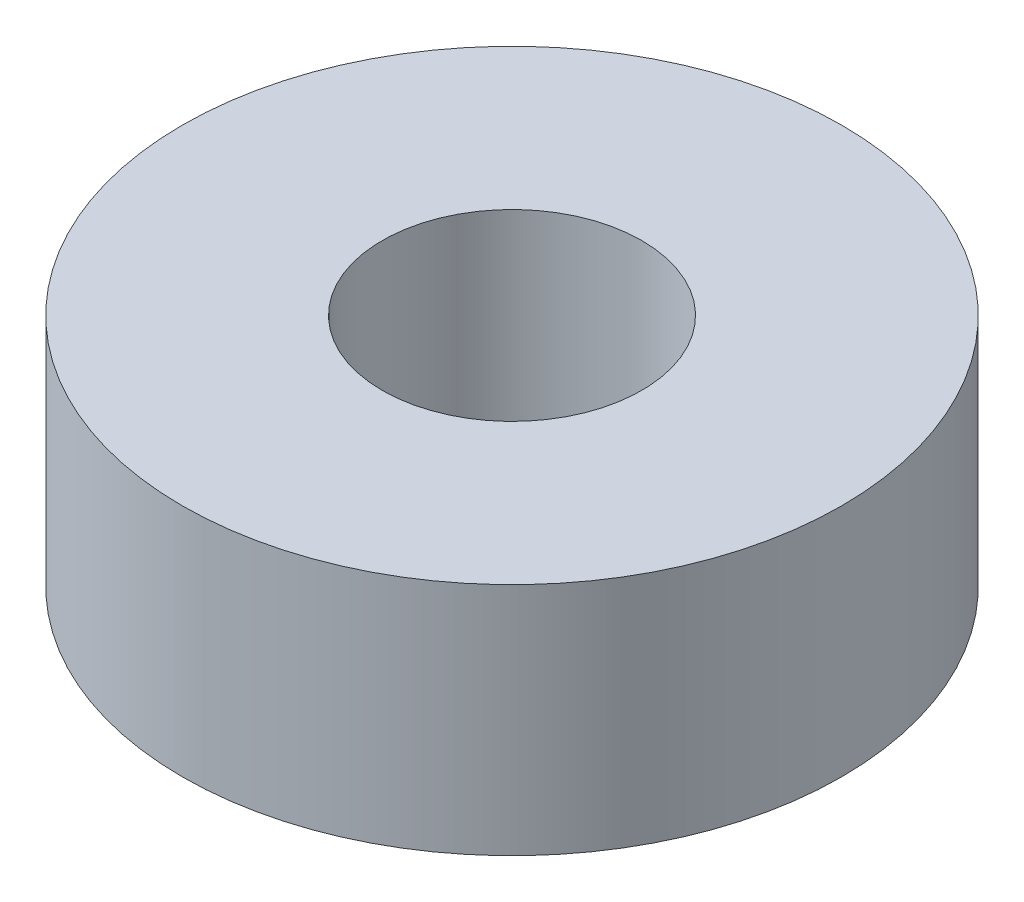
ISO-10303-21;
HEADER;
FILE_DESCRIPTION(('STEP AP214'),'2;1');
FILE_NAME('part.step','',(''),(''),'','','');
FILE_SCHEMA(('AUTOMOTIVE_DESIGN { 1 0 10303 214 1 1 1 1 }'));
ENDSEC;
DATA;
#1=APPLICATION_CONTEXT('core data for automotive mechanical design processes');
#2=APPLICATION_PROTOCOL_DEFINITION('international standard','automotive_design',2000,#1);
#3=PRODUCT_CONTEXT('',#1,'mechanical');
#4=PRODUCT('Part','Part','',(#3));
#5=PRODUCT_RELATED_PRODUCT_CATEGORY('part','',(#4));
#6=PRODUCT_DEFINITION_FORMATION('','',#4);
#7=PRODUCT_DEFINITION_CONTEXT('part definition',#1,'design');
#8=PRODUCT_DEFINITION('design','',#6,#7);
#9=PRODUCT_DEFINITION_SHAPE('','',#8);
#10=(LENGTH_UNIT() NAMED_UNIT(*) SI_UNIT(.MILLI.,.METRE.));
#11=(NAMED_UNIT(*) PLANE_ANGLE_UNIT() SI_UNIT($,.RADIAN.));
#12=(NAMED_UNIT(*) SI_UNIT($,.STERADIAN.) SOLID_ANGLE_UNIT());
#13=UNCERTAINTY_MEASURE_WITH_UNIT(LENGTH_MEASURE(1.E-05),#10,'distance_accuracy_value','');
#14=(GEOMETRIC_REPRESENTATION_CONTEXT(3) GLOBAL_UNCERTAINTY_ASSIGNED_CONTEXT((#13)) GLOBAL_UNIT_ASSIGNED_CONTEXT((#10,
#11,#12)) REPRESENTATION_CONTEXT('',''));
#15=CARTESIAN_POINT('',(0.,0.,0.));
#16=DIRECTION('',(0.,0.,1.));
#17=DIRECTION('',(1.,0.,0.));
#18=AXIS2_PLACEMENT_3D('',#15,#16,#17);
#19=CARTESIAN_POINT('',(0.,4.5212,0.));
#20=DIRECTION('',(0.,1.,0.));
#21=DIRECTION('',(0.,0.,1.));
#22=AXIS2_PLACEMENT_3D('',#19,#20,#21);
#23=PLANE('',#22);
#24=CARTESIAN_POINT('',(0.,4.5212,0.));
#25=DIRECTION('',(0.,1.,0.));
#26=DIRECTION('',(0.,0.,1.));
#27=AXIS2_PLACEMENT_3D('',#24,#25,#26);
#28=CIRCLE('',#27,6.35);
#29=CARTESIAN_POINT('',(0.,4.5212,6.35));
#30=VERTEX_POINT('',#29);
#31=EDGE_CURVE('E10',#30,#30,#28,.T.);
#32=ORIENTED_EDGE('',*,*,#31,.T.);
#33=EDGE_LOOP('',(#32));
#34=FACE_BOUND('',#33,.T.);
#35=CARTESIAN_POINT('',(0.,4.5212,0.));
#36=DIRECTION('',(0.,1.,0.));
#37=DIRECTION('',(0.,0.,1.));
#38=AXIS2_PLACEMENT_3D('',#35,#36,#37);
#39=CIRCLE('',#38,2.5);
#40=CARTESIAN_POINT('',(0.,4.5212,2.5));
#41=VERTEX_POINT('',#40);
#42=EDGE_CURVE('E42',#41,#41,#39,.T.);
#43=ORIENTED_EDGE('',*,*,#42,.F.);
#44=EDGE_LOOP('',(#43));
#45=FACE_BOUND('',#44,.T.);
#46=ADVANCED_FACE('F31',(#34,#45),#23,.T.);
#47=CARTESIAN_POINT('',(0.,0.,0.));
#48=DIRECTION('',(0.,1.,0.));
#49=DIRECTION('',(0.,0.,1.));
#50=AXIS2_PLACEMENT_3D('',#47,#48,#49);
#51=PLANE('',#50);
#52=CARTESIAN_POINT('',(0.,0.,0.));
#53=DIRECTION('',(0.,1.,0.));
#54=DIRECTION('',(0.,0.,1.));
#55=AXIS2_PLACEMENT_3D('',#52,#53,#54);
#56=CIRCLE('',#55,6.35);
#57=CARTESIAN_POINT('',(0.,0.,6.35));
#58=VERTEX_POINT('',#57);
#59=EDGE_CURVE('E35',#58,#58,#56,.T.);
#60=ORIENTED_EDGE('',*,*,#59,.F.);
#61=EDGE_LOOP('',(#60));
#62=FACE_BOUND('',#61,.T.);
#63=CARTESIAN_POINT('',(0.,0.,0.));
#64=DIRECTION('',(0.,1.,0.));
#65=DIRECTION('',(0.,0.,1.));
#66=AXIS2_PLACEMENT_3D('',#63,#64,#65);
#67=CIRCLE('',#66,2.5);
#68=CARTESIAN_POINT('',(0.,0.,2.5));
#69=VERTEX_POINT('',#68);
#70=EDGE_CURVE('E44',#69,#69,#67,.T.);
#71=ORIENTED_EDGE('',*,*,#70,.T.);
#72=EDGE_LOOP('',(#71));
#73=FACE_BOUND('',#72,.T.);
#74=ADVANCED_FACE('F54',(#62,#73),#51,.F.);
#75=CARTESIAN_POINT('',(0.,4.5212,0.));
#76=DIRECTION('',(0.,-1.,0.));
#77=DIRECTION('',(0.,0.,-1.));
#78=AXIS2_PLACEMENT_3D('',#75,#76,#77);
#79=CYLINDRICAL_SURFACE('',#78,6.35);
#80=ORIENTED_EDGE('',*,*,#31,.F.);
#81=EDGE_LOOP('',(#80));
#82=FACE_BOUND('',#81,.T.);
#83=ORIENTED_EDGE('',*,*,#59,.T.);
#84=EDGE_LOOP('',(#83));
#85=FACE_BOUND('',#84,.T.);
#86=ADVANCED_FACE('F33',(#82,#85),#79,.T.);
#87=CARTESIAN_POINT('',(0.,4.5212,0.));
#88=DIRECTION('',(0.,-1.,0.));
#89=DIRECTION('',(0.,0.,-1.));
#90=AXIS2_PLACEMENT_3D('',#87,#88,#89);
#91=CYLINDRICAL_SURFACE('',#90,2.5);
#92=ORIENTED_EDGE('',*,*,#42,.T.);
#93=EDGE_LOOP('',(#92));
#94=FACE_BOUND('',#93,.T.);
#95=ORIENTED_EDGE('',*,*,#70,.F.);
#96=EDGE_LOOP('',(#95));
#97=FACE_BOUND('',#96,.T.);
#98=ADVANCED_FACE('F50',(#94,#97),#91,.F.);
#99=CLOSED_SHELL('',(#46,#74,#86,#98));
#100=MANIFOLD_SOLID_BREP('B2',#99);
#101=ADVANCED_BREP_SHAPE_REPRESENTATION('',(#18,#100),#14);
#102=SHAPE_DEFINITION_REPRESENTATION(#9,#101);
ENDSEC;
END-ISO-10303-21;
